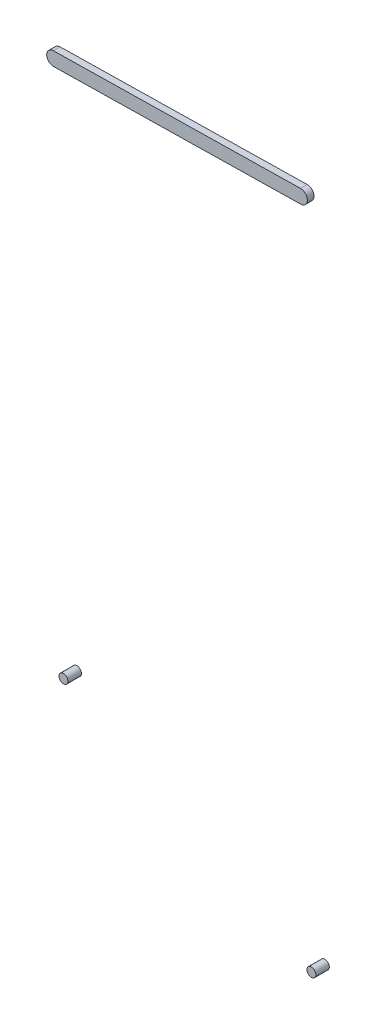
ISO-10303-21;
HEADER;
FILE_DESCRIPTION(('STEP AP214'),'2;1');
FILE_NAME('part.step','',(''),(''),'','','');
FILE_SCHEMA(('AUTOMOTIVE_DESIGN { 1 0 10303 214 1 1 1 1 }'));
ENDSEC;
DATA;
#1=APPLICATION_CONTEXT('core data for automotive mechanical design processes');
#2=APPLICATION_PROTOCOL_DEFINITION('international standard','automotive_design',2000,#1);
#3=PRODUCT_CONTEXT('',#1,'mechanical');
#4=PRODUCT('Part','Part','',(#3));
#5=PRODUCT_RELATED_PRODUCT_CATEGORY('part','',(#4));
#6=PRODUCT_DEFINITION_FORMATION('','',#4);
#7=PRODUCT_DEFINITION_CONTEXT('part definition',#1,'design');
#8=PRODUCT_DEFINITION('design','',#6,#7);
#9=PRODUCT_DEFINITION_SHAPE('','',#8);
#10=(LENGTH_UNIT() NAMED_UNIT(*) SI_UNIT(.MILLI.,.METRE.));
#11=(NAMED_UNIT(*) PLANE_ANGLE_UNIT() SI_UNIT($,.RADIAN.));
#12=(NAMED_UNIT(*) SI_UNIT($,.STERADIAN.) SOLID_ANGLE_UNIT());
#13=UNCERTAINTY_MEASURE_WITH_UNIT(LENGTH_MEASURE(1.E-05),#10,'distance_accuracy_value','');
#14=(GEOMETRIC_REPRESENTATION_CONTEXT(3) GLOBAL_UNCERTAINTY_ASSIGNED_CONTEXT((#13)) GLOBAL_UNIT_ASSIGNED_CONTEXT((#10,
#11,#12)) REPRESENTATION_CONTEXT('',''));
#15=CARTESIAN_POINT('',(0.,0.,0.));
#16=DIRECTION('',(0.,0.,1.));
#17=DIRECTION('',(1.,0.,0.));
#18=AXIS2_PLACEMENT_3D('',#15,#16,#17);
#19=CARTESIAN_POINT('',(-54.3138839317426,-105.968422815213,-3.));
#20=DIRECTION('',(0.,0.,1.));
#21=DIRECTION('',(1.,0.,0.));
#22=AXIS2_PLACEMENT_3D('',#19,#20,#21);
#23=CYLINDRICAL_SURFACE('',#22,0.999999999999998);
#24=CARTESIAN_POINT('',(-54.3138839317426,-105.968422815213,-3.));
#25=DIRECTION('',(0.,0.,-1.));
#26=DIRECTION('',(-1.,0.,0.));
#27=AXIS2_PLACEMENT_3D('',#24,#25,#26);
#28=CIRCLE('',#27,0.999999999999998);
#29=CARTESIAN_POINT('',(-55.3138839317426,-105.968422815213,-3.));
#30=VERTEX_POINT('',#29);
#31=EDGE_CURVE('E44',#30,#30,#28,.T.);
#32=ORIENTED_EDGE('',*,*,#31,.F.);
#33=EDGE_LOOP('',(#32));
#34=FACE_BOUND('',#33,.T.);
#35=CARTESIAN_POINT('',(-54.3138839317426,-105.968422815213,0.));
#36=DIRECTION('',(0.,0.,-1.));
#37=DIRECTION('',(-1.,0.,0.));
#38=AXIS2_PLACEMENT_3D('',#35,#36,#37);
#39=CIRCLE('',#38,0.999999999999998);
#40=CARTESIAN_POINT('',(-55.3138839317426,-105.968422815213,0.));
#41=VERTEX_POINT('',#40);
#42=EDGE_CURVE('E11',#41,#41,#39,.T.);
#43=ORIENTED_EDGE('',*,*,#42,.T.);
#44=EDGE_LOOP('',(#43));
#45=FACE_BOUND('',#44,.T.);
#46=ADVANCED_FACE('F40',(#34,#45),#23,.T.);
#47=CARTESIAN_POINT('',(-54.3138839317426,-105.968422815213,-3.));
#48=DIRECTION('',(0.,0.,-1.));
#49=DIRECTION('',(-1.,0.,0.));
#50=AXIS2_PLACEMENT_3D('',#47,#48,#49);
#51=PLANE('',#50);
#52=ORIENTED_EDGE('',*,*,#31,.T.);
#53=EDGE_LOOP('',(#52));
#54=FACE_BOUND('',#53,.T.);
#55=ADVANCED_FACE('F42',(#54),#51,.T.);
#56=CARTESIAN_POINT('',(-54.3138839317426,-105.968422815213,0.));
#57=DIRECTION('',(0.,0.,-1.));
#58=DIRECTION('',(-1.,0.,0.));
#59=AXIS2_PLACEMENT_3D('',#56,#57,#58);
#60=PLANE('',#59);
#61=ORIENTED_EDGE('',*,*,#42,.F.);
#62=EDGE_LOOP('',(#61));
#63=FACE_BOUND('',#62,.T.);
#64=ADVANCED_FACE('F59',(#63),#60,.F.);
#65=CLOSED_SHELL('',(#46,#55,#64));
#66=MANIFOLD_SOLID_BREP('B2',#65);
#67=CARTESIAN_POINT('',(0.90710335238089,-134.997257186513,-3.));
#68=DIRECTION('',(0.,0.,1.));
#69=DIRECTION('',(1.,0.,0.));
#70=AXIS2_PLACEMENT_3D('',#67,#68,#69);
#71=CYLINDRICAL_SURFACE('',#70,1.);
#72=CARTESIAN_POINT('',(0.90710335238089,-134.997257186513,-3.));
#73=DIRECTION('',(0.,0.,-1.));
#74=DIRECTION('',(-1.,0.,0.));
#75=AXIS2_PLACEMENT_3D('',#72,#73,#74);
#76=CIRCLE('',#75,1.);
#77=CARTESIAN_POINT('',(-0.0928966476191129,-134.997257186513,-3.));
#78=VERTEX_POINT('',#77);
#79=EDGE_CURVE('E39',#78,#78,#76,.T.);
#80=ORIENTED_EDGE('',*,*,#79,.F.);
#81=EDGE_LOOP('',(#80));
#82=FACE_BOUND('',#81,.T.);
#83=CARTESIAN_POINT('',(0.90710335238089,-134.997257186513,0.));
#84=DIRECTION('',(0.,0.,-1.));
#85=DIRECTION('',(-1.,0.,0.));
#86=AXIS2_PLACEMENT_3D('',#83,#84,#85);
#87=CIRCLE('',#86,1.);
#88=CARTESIAN_POINT('',(-0.0928966476191129,-134.997257186513,0.));
#89=VERTEX_POINT('',#88);
#90=EDGE_CURVE('E93',#89,#89,#87,.T.);
#91=ORIENTED_EDGE('',*,*,#90,.T.);
#92=EDGE_LOOP('',(#91));
#93=FACE_BOUND('',#92,.T.);
#94=ADVANCED_FACE('F90',(#82,#93),#71,.T.);
#95=CARTESIAN_POINT('',(0.90710335238089,-134.997257186513,-3.));
#96=DIRECTION('',(0.,0.,-1.));
#97=DIRECTION('',(-1.,0.,0.));
#98=AXIS2_PLACEMENT_3D('',#95,#96,#97);
#99=PLANE('',#98);
#100=ORIENTED_EDGE('',*,*,#79,.T.);
#101=EDGE_LOOP('',(#100));
#102=FACE_BOUND('',#101,.T.);
#103=ADVANCED_FACE('F105',(#102),#99,.T.);
#104=CARTESIAN_POINT('',(0.90710335238089,-134.997257186513,0.));
#105=DIRECTION('',(0.,0.,-1.));
#106=DIRECTION('',(-1.,0.,0.));
#107=AXIS2_PLACEMENT_3D('',#104,#105,#106);
#108=PLANE('',#107);
#109=ORIENTED_EDGE('',*,*,#90,.F.);
#110=EDGE_LOOP('',(#109));
#111=FACE_BOUND('',#110,.T.);
#112=ADVANCED_FACE('F103',(#111),#108,.F.);
#113=CLOSED_SHELL('',(#94,#103,#112));
#114=MANIFOLD_SOLID_BREP('B6',#113);
#115=CARTESIAN_POINT('',(-55.0395666136221,14.0293829340511,1.5));
#116=DIRECTION('',(0.,0.,-1.));
#117=DIRECTION('',(-1.,0.,0.));
#118=AXIS2_PLACEMENT_3D('',#115,#116,#117);
#119=CYLINDRICAL_SURFACE('',#118,1.51127539357468);
#120=CARTESIAN_POINT('',(-55.0395666136221,14.0293829340511,0.));
#121=DIRECTION('',(0.,0.,1.));
#122=DIRECTION('',(1.,0.,0.));
#123=AXIS2_PLACEMENT_3D('',#120,#121,#122);
#124=CIRCLE('',#123,1.51127539357468);
#125=CARTESIAN_POINT('',(-55.0662136557625,15.540423386974,0.));
#126=VERTEX_POINT('',#125);
#127=CARTESIAN_POINT('',(-55.0129195714816,12.5183424811282,0.));
#128=VERTEX_POINT('',#127);
#129=EDGE_CURVE('E194',#126,#128,#124,.T.);
#130=ORIENTED_EDGE('',*,*,#129,.T.);
#131=DIRECTION('',(0.,0.,-1.));
#132=VECTOR('',#131,1.);
#133=CARTESIAN_POINT('',(-55.0129195714816,12.5183424811282,1.5));
#134=LINE('',#133,#132);
#135=CARTESIAN_POINT('',(-55.0129195714816,12.5183424811282,1.5));
#136=VERTEX_POINT('',#135);
#137=EDGE_CURVE('E88',#136,#128,#134,.T.);
#138=ORIENTED_EDGE('',*,*,#137,.F.);
#139=CARTESIAN_POINT('',(-55.0395666136221,14.0293829340511,1.5));
#140=DIRECTION('',(0.,0.,1.));
#141=DIRECTION('',(1.,0.,0.));
#142=AXIS2_PLACEMENT_3D('',#139,#140,#141);
#143=CIRCLE('',#142,1.51127539357468);
#144=CARTESIAN_POINT('',(-55.0662136557625,15.540423386974,1.5));
#145=VERTEX_POINT('',#144);
#146=EDGE_CURVE('E180',#145,#136,#143,.T.);
#147=ORIENTED_EDGE('',*,*,#146,.F.);
#148=DIRECTION('',(0.,0.,-1.));
#149=VECTOR('',#148,1.);
#150=CARTESIAN_POINT('',(-55.0662136557625,15.540423386974,1.5));
#151=LINE('',#150,#149);
#152=EDGE_CURVE('E147',#145,#126,#151,.T.);
#153=ORIENTED_EDGE('',*,*,#152,.T.);
#154=EDGE_LOOP('',(#130,#138,#147,#153));
#155=FACE_BOUND('',#154,.T.);
#156=ADVANCED_FACE('F131',(#155),#119,.T.);
#157=CARTESIAN_POINT('',(-55.0129195714816,12.5183424811282,1.5));
#158=DIRECTION('',(-0.0176321551014163,0.999844541469562,0.));
#159=DIRECTION('',(-0.999844541469562,-0.0176321551014163,0.));
#160=AXIS2_PLACEMENT_3D('',#157,#158,#159);
#161=PLANE('',#160);
#162=DIRECTION('',(0.999844541469562,0.0176321551014163,0.));
#163=VECTOR('',#162,1.);
#164=CARTESIAN_POINT('',(-55.0129195714816,12.5183424811282,0.));
#165=LINE('',#164,#163);
#166=CARTESIAN_POINT('',(0.0266470421404468,13.488959547077,0.));
#167=VERTEX_POINT('',#166);
#168=EDGE_CURVE('E185',#128,#167,#165,.T.);
#169=ORIENTED_EDGE('',*,*,#168,.T.);
#170=DIRECTION('',(0.,0.,-1.));
#171=VECTOR('',#170,1.);
#172=CARTESIAN_POINT('',(0.0266470421404468,13.488959547077,1.5));
#173=LINE('',#172,#171);
#174=CARTESIAN_POINT('',(0.0266470421404468,13.488959547077,1.5));
#175=VERTEX_POINT('',#174);
#176=EDGE_CURVE('E139',#175,#167,#173,.T.);
#177=ORIENTED_EDGE('',*,*,#176,.F.);
#178=DIRECTION('',(0.999844541469562,0.0176321551014163,0.));
#179=VECTOR('',#178,1.);
#180=CARTESIAN_POINT('',(-55.0129195714816,12.5183424811282,1.5));
#181=LINE('',#180,#179);
#182=EDGE_CURVE('E173',#136,#175,#181,.T.);
#183=ORIENTED_EDGE('',*,*,#182,.F.);
#184=ORIENTED_EDGE('',*,*,#137,.T.);
#185=EDGE_LOOP('',(#169,#177,#183,#184));
#186=FACE_BOUND('',#185,.T.);
#187=ADVANCED_FACE('F184',(#186),#161,.F.);
#188=CARTESIAN_POINT('',(0.,14.9999999999999,1.5));
#189=DIRECTION('',(0.,0.,-1.));
#190=DIRECTION('',(-1.,0.,0.));
#191=AXIS2_PLACEMENT_3D('',#188,#189,#190);
#192=CYLINDRICAL_SURFACE('',#191,1.51127539357468);
#193=CARTESIAN_POINT('',(0.,14.9999999999999,0.));
#194=DIRECTION('',(0.,0.,1.));
#195=DIRECTION('',(1.,0.,0.));
#196=AXIS2_PLACEMENT_3D('',#193,#194,#195);
#197=CIRCLE('',#196,1.51127539357468);
#198=CARTESIAN_POINT('',(-0.0266470421404774,16.5110404529228,0.));
#199=VERTEX_POINT('',#198);
#200=EDGE_CURVE('E197',#167,#199,#197,.T.);
#201=ORIENTED_EDGE('',*,*,#200,.T.);
#202=DIRECTION('',(0.,0.,-1.));
#203=VECTOR('',#202,1.);
#204=CARTESIAN_POINT('',(-0.0266470421404774,16.5110404529228,1.5));
#205=LINE('',#204,#203);
#206=CARTESIAN_POINT('',(-0.0266470421404774,16.5110404529228,1.5));
#207=VERTEX_POINT('',#206);
#208=EDGE_CURVE('E162',#207,#199,#205,.T.);
#209=ORIENTED_EDGE('',*,*,#208,.F.);
#210=CARTESIAN_POINT('',(0.,14.9999999999999,1.5));
#211=DIRECTION('',(0.,0.,1.));
#212=DIRECTION('',(1.,0.,0.));
#213=AXIS2_PLACEMENT_3D('',#210,#211,#212);
#214=CIRCLE('',#213,1.51127539357468);
#215=EDGE_CURVE('E179',#175,#207,#214,.T.);
#216=ORIENTED_EDGE('',*,*,#215,.F.);
#217=ORIENTED_EDGE('',*,*,#176,.T.);
#218=EDGE_LOOP('',(#201,#209,#216,#217));
#219=FACE_BOUND('',#218,.T.);
#220=ADVANCED_FACE('F188',(#219),#192,.T.);
#221=CARTESIAN_POINT('',(-55.0662136557625,15.540423386974,1.5));
#222=DIRECTION('',(-0.0176321551014164,0.999844541469562,0.));
#223=DIRECTION('',(-0.999844541469562,-0.0176321551014164,0.));
#224=AXIS2_PLACEMENT_3D('',#221,#222,#223);
#225=PLANE('',#224);
#226=DIRECTION('',(0.999844541469562,0.0176321551014164,0.));
#227=VECTOR('',#226,1.);
#228=CARTESIAN_POINT('',(-55.0662136557625,15.540423386974,0.));
#229=LINE('',#228,#227);
#230=EDGE_CURVE('E199',#126,#199,#229,.T.);
#231=ORIENTED_EDGE('',*,*,#230,.F.);
#232=ORIENTED_EDGE('',*,*,#152,.F.);
#233=DIRECTION('',(0.999844541469562,0.0176321551014164,0.));
#234=VECTOR('',#233,1.);
#235=CARTESIAN_POINT('',(-55.0662136557625,15.540423386974,1.5));
#236=LINE('',#235,#234);
#237=EDGE_CURVE('E189',#145,#207,#236,.T.);
#238=ORIENTED_EDGE('',*,*,#237,.T.);
#239=ORIENTED_EDGE('',*,*,#208,.T.);
#240=EDGE_LOOP('',(#231,#232,#238,#239));
#241=FACE_BOUND('',#240,.T.);
#242=ADVANCED_FACE('F205',(#241),#225,.T.);
#243=CARTESIAN_POINT('',(-55.0395666136221,14.0293829340511,1.5));
#244=DIRECTION('',(0.,0.,1.));
#245=DIRECTION('',(1.,0.,0.));
#246=AXIS2_PLACEMENT_3D('',#243,#244,#245);
#247=PLANE('',#246);
#248=ORIENTED_EDGE('',*,*,#146,.T.);
#249=ORIENTED_EDGE('',*,*,#182,.T.);
#250=ORIENTED_EDGE('',*,*,#215,.T.);
#251=ORIENTED_EDGE('',*,*,#237,.F.);
#252=EDGE_LOOP('',(#248,#249,#250,#251));
#253=FACE_BOUND('',#252,.T.);
#254=ADVANCED_FACE('F176',(#253),#247,.T.);
#255=CARTESIAN_POINT('',(-55.0395666136221,14.0293829340511,0.));
#256=DIRECTION('',(0.,0.,1.));
#257=DIRECTION('',(1.,0.,0.));
#258=AXIS2_PLACEMENT_3D('',#255,#256,#257);
#259=PLANE('',#258);
#260=ORIENTED_EDGE('',*,*,#129,.F.);
#261=ORIENTED_EDGE('',*,*,#230,.T.);
#262=ORIENTED_EDGE('',*,*,#200,.F.);
#263=ORIENTED_EDGE('',*,*,#168,.F.);
#264=EDGE_LOOP('',(#260,#261,#262,#263));
#265=FACE_BOUND('',#264,.T.);
#266=ADVANCED_FACE('F204',(#265),#259,.F.);
#267=CLOSED_SHELL('',(#156,#187,#220,#242,#254,#266));
#268=MANIFOLD_SOLID_BREP('B34',#267);
#269=ADVANCED_BREP_SHAPE_REPRESENTATION('',(#18,#66,#114,#268),#14);
#270=SHAPE_DEFINITION_REPRESENTATION(#9,#269);
ENDSEC;
END-ISO-10303-21;
